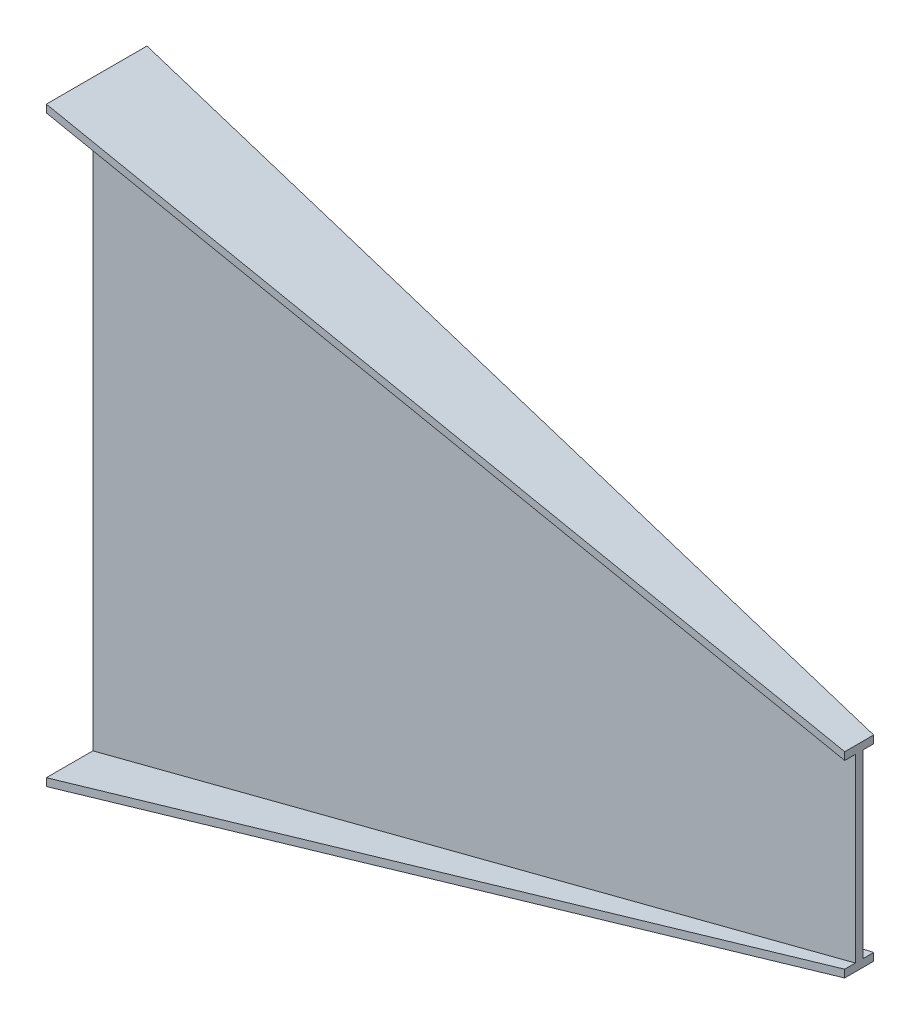
ISO-10303-21;
HEADER;
FILE_DESCRIPTION(('STEP AP214'),'2;1');
FILE_NAME('part.step','',(''),(''),'','','');
FILE_SCHEMA(('AUTOMOTIVE_DESIGN { 1 0 10303 214 1 1 1 1 }'));
ENDSEC;
DATA;
#1=APPLICATION_CONTEXT('core data for automotive mechanical design processes');
#2=APPLICATION_PROTOCOL_DEFINITION('international standard','automotive_design',2000,#1);
#3=PRODUCT_CONTEXT('',#1,'mechanical');
#4=PRODUCT('Part','Part','',(#3));
#5=PRODUCT_RELATED_PRODUCT_CATEGORY('part','',(#4));
#6=PRODUCT_DEFINITION_FORMATION('','',#4);
#7=PRODUCT_DEFINITION_CONTEXT('part definition',#1,'design');
#8=PRODUCT_DEFINITION('design','',#6,#7);
#9=PRODUCT_DEFINITION_SHAPE('','',#8);
#10=(LENGTH_UNIT() NAMED_UNIT(*) SI_UNIT(.MILLI.,.METRE.));
#11=(NAMED_UNIT(*) PLANE_ANGLE_UNIT() SI_UNIT($,.RADIAN.));
#12=(NAMED_UNIT(*) SI_UNIT($,.STERADIAN.) SOLID_ANGLE_UNIT());
#13=UNCERTAINTY_MEASURE_WITH_UNIT(LENGTH_MEASURE(1.E-05),#10,'distance_accuracy_value','');
#14=(GEOMETRIC_REPRESENTATION_CONTEXT(3) GLOBAL_UNCERTAINTY_ASSIGNED_CONTEXT((#13)) GLOBAL_UNIT_ASSIGNED_CONTEXT((#10,
#11,#12)) REPRESENTATION_CONTEXT('',''));
#15=CARTESIAN_POINT('',(0.,0.,0.));
#16=DIRECTION('',(0.,0.,1.));
#17=DIRECTION('',(1.,0.,0.));
#18=AXIS2_PLACEMENT_3D('',#15,#16,#17);
#19=CARTESIAN_POINT('',(1000.,0.,0.));
#20=DIRECTION('',(-1.,0.,0.));
#21=DIRECTION('',(0.,0.,1.));
#22=AXIS2_PLACEMENT_3D('',#19,#20,#21);
#23=PLANE('',#22);
#24=DIRECTION('',(0.,-1.,0.));
#25=VECTOR('',#24,1.);
#26=CARTESIAN_POINT('',(1000.,128.5,-13.9999999999996));
#27=LINE('',#26,#25);
#28=CARTESIAN_POINT('',(1000.,128.5,-13.9999999999996));
#29=VERTEX_POINT('',#28);
#30=CARTESIAN_POINT('',(1000.,118.5,-13.9999999999996));
#31=VERTEX_POINT('',#30);
#32=EDGE_CURVE('E377',#29,#31,#27,.T.);
#33=ORIENTED_EDGE('',*,*,#32,.F.);
#34=DIRECTION('',(0.,0.,-1.));
#35=VECTOR('',#34,1.);
#36=CARTESIAN_POINT('',(1000.,128.5,-13.9999999999996));
#37=LINE('',#36,#35);
#38=CARTESIAN_POINT('',(1000.,128.5,24.0000000000005));
#39=VERTEX_POINT('',#38);
#40=EDGE_CURVE('E12',#39,#29,#37,.T.);
#41=ORIENTED_EDGE('',*,*,#40,.F.);
#42=DIRECTION('',(0.,1.,0.));
#43=VECTOR('',#42,1.);
#44=CARTESIAN_POINT('',(1000.,128.5,24.0000000000005));
#45=LINE('',#44,#43);
#46=CARTESIAN_POINT('',(1000.,118.5,24.0000000000005));
#47=VERTEX_POINT('',#46);
#48=EDGE_CURVE('E71',#47,#39,#45,.T.);
#49=ORIENTED_EDGE('',*,*,#48,.F.);
#50=DIRECTION('',(0.,0.,1.));
#51=VECTOR('',#50,1.);
#52=CARTESIAN_POINT('',(1000.,118.5,10.0000000000005));
#53=LINE('',#52,#51);
#54=CARTESIAN_POINT('',(1000.,118.5,10.0000000000005));
#55=VERTEX_POINT('',#54);
#56=EDGE_CURVE('E652',#55,#47,#53,.T.);
#57=ORIENTED_EDGE('',*,*,#56,.F.);
#58=DIRECTION('',(0.,1.,0.));
#59=VECTOR('',#58,1.);
#60=CARTESIAN_POINT('',(1000.,118.5,10.0000000000005));
#61=LINE('',#60,#59);
#62=CARTESIAN_POINT('',(1000.,-118.5,10.0000000000005));
#63=VERTEX_POINT('',#62);
#64=EDGE_CURVE('E414',#63,#55,#61,.T.);
#65=ORIENTED_EDGE('',*,*,#64,.F.);
#66=DIRECTION('',(0.,0.,-1.));
#67=VECTOR('',#66,1.);
#68=CARTESIAN_POINT('',(1000.,-118.5,10.0000000000005));
#69=LINE('',#68,#67);
#70=CARTESIAN_POINT('',(1000.,-118.5,24.0000000000005));
#71=VERTEX_POINT('',#70);
#72=EDGE_CURVE('E428',#71,#63,#69,.T.);
#73=ORIENTED_EDGE('',*,*,#72,.F.);
#74=DIRECTION('',(0.,1.,0.));
#75=VECTOR('',#74,1.);
#76=CARTESIAN_POINT('',(1000.,-118.5,24.0000000000005));
#77=LINE('',#76,#75);
#78=CARTESIAN_POINT('',(1000.,-128.5,24.0000000000005));
#79=VERTEX_POINT('',#78);
#80=EDGE_CURVE('E442',#79,#71,#77,.T.);
#81=ORIENTED_EDGE('',*,*,#80,.F.);
#82=DIRECTION('',(0.,0.,1.));
#83=VECTOR('',#82,1.);
#84=CARTESIAN_POINT('',(1000.,-128.5,-13.9999999999996));
#85=LINE('',#84,#83);
#86=CARTESIAN_POINT('',(1000.,-128.5,-13.9999999999996));
#87=VERTEX_POINT('',#86);
#88=EDGE_CURVE('E623',#87,#79,#85,.T.);
#89=ORIENTED_EDGE('',*,*,#88,.F.);
#90=DIRECTION('',(0.,-1.,0.));
#91=VECTOR('',#90,1.);
#92=CARTESIAN_POINT('',(1000.,-118.5,-13.9999999999996));
#93=LINE('',#92,#91);
#94=CARTESIAN_POINT('',(1000.,-118.5,-13.9999999999996));
#95=VERTEX_POINT('',#94);
#96=EDGE_CURVE('E615',#95,#87,#93,.T.);
#97=ORIENTED_EDGE('',*,*,#96,.F.);
#98=DIRECTION('',(0.,0.,-1.));
#99=VECTOR('',#98,1.);
#100=CARTESIAN_POINT('',(1000.,-118.5,-13.9999999999996));
#101=LINE('',#100,#99);
#102=CARTESIAN_POINT('',(1000.,-118.5,4.44089209850063E-13));
#103=VERTEX_POINT('',#102);
#104=EDGE_CURVE('E530',#103,#95,#101,.T.);
#105=ORIENTED_EDGE('',*,*,#104,.F.);
#106=DIRECTION('',(0.,-1.,0.));
#107=VECTOR('',#106,1.);
#108=CARTESIAN_POINT('',(1000.,118.5,4.44089209850063E-13));
#109=LINE('',#108,#107);
#110=CARTESIAN_POINT('',(1000.,118.5,4.44089209850063E-13));
#111=VERTEX_POINT('',#110);
#112=EDGE_CURVE('E85',#111,#103,#109,.T.);
#113=ORIENTED_EDGE('',*,*,#112,.F.);
#114=DIRECTION('',(0.,0.,1.));
#115=VECTOR('',#114,1.);
#116=CARTESIAN_POINT('',(1000.,118.5,-13.9999999999996));
#117=LINE('',#116,#115);
#118=EDGE_CURVE('E79',#31,#111,#117,.T.);
#119=ORIENTED_EDGE('',*,*,#118,.F.);
#120=EDGE_LOOP('',(#33,#41,#49,#57,#65,#73,#81,#89,#97,#105,#113,#119));
#121=FACE_BOUND('',#120,.T.);
#122=ADVANCED_FACE('F61',(#121),#23,.F.);
#123=CARTESIAN_POINT('',(0.,0.,0.));
#124=DIRECTION('',(1.,0.,0.));
#125=DIRECTION('',(0.,0.,-1.));
#126=AXIS2_PLACEMENT_3D('',#123,#124,#125);
#127=PLANE('',#126);
#128=DIRECTION('',(0.,-1.,0.));
#129=VECTOR('',#128,1.);
#130=CARTESIAN_POINT('',(0.,387.5,71.0000000000003));
#131=LINE('',#130,#129);
#132=CARTESIAN_POINT('',(0.,387.5,71.0000000000003));
#133=VERTEX_POINT('',#132);
#134=CARTESIAN_POINT('',(0.,377.5,71.0000000000003));
#135=VERTEX_POINT('',#134);
#136=EDGE_CURVE('E160',#133,#135,#131,.T.);
#137=ORIENTED_EDGE('',*,*,#136,.F.);
#138=DIRECTION('',(0.,0.,1.));
#139=VECTOR('',#138,1.);
#140=CARTESIAN_POINT('',(0.,387.5,71.0000000000003));
#141=LINE('',#140,#139);
#142=CARTESIAN_POINT('',(0.,387.5,-60.9999999999997));
#143=VERTEX_POINT('',#142);
#144=EDGE_CURVE('E169',#143,#133,#141,.T.);
#145=ORIENTED_EDGE('',*,*,#144,.F.);
#146=DIRECTION('',(0.,1.,0.));
#147=VECTOR('',#146,1.);
#148=CARTESIAN_POINT('',(0.,387.5,-60.9999999999997));
#149=LINE('',#148,#147);
#150=CARTESIAN_POINT('',(0.,377.5,-60.9999999999997));
#151=VERTEX_POINT('',#150);
#152=EDGE_CURVE('E176',#151,#143,#149,.T.);
#153=ORIENTED_EDGE('',*,*,#152,.F.);
#154=DIRECTION('',(0.,0.,-1.));
#155=VECTOR('',#154,1.);
#156=CARTESIAN_POINT('',(0.,377.5,3.05685116652754E-13));
#157=LINE('',#156,#155);
#158=CARTESIAN_POINT('',(0.,377.5,3.05685116652754E-13));
#159=VERTEX_POINT('',#158);
#160=EDGE_CURVE('E300',#159,#151,#157,.T.);
#161=ORIENTED_EDGE('',*,*,#160,.F.);
#162=DIRECTION('',(0.,1.,0.));
#163=VECTOR('',#162,1.);
#164=CARTESIAN_POINT('',(0.,377.5,3.05685116652754E-13));
#165=LINE('',#164,#163);
#166=CARTESIAN_POINT('',(0.,-377.5,3.05685116652754E-13));
#167=VERTEX_POINT('',#166);
#168=EDGE_CURVE('E296',#167,#159,#165,.T.);
#169=ORIENTED_EDGE('',*,*,#168,.F.);
#170=DIRECTION('',(0.,0.,1.));
#171=VECTOR('',#170,1.);
#172=CARTESIAN_POINT('',(0.,-377.5,3.05685116652754E-13));
#173=LINE('',#172,#171);
#174=CARTESIAN_POINT('',(0.,-377.5,-61.));
#175=VERTEX_POINT('',#174);
#176=EDGE_CURVE('E292',#175,#167,#173,.T.);
#177=ORIENTED_EDGE('',*,*,#176,.F.);
#178=DIRECTION('',(0.,1.,0.));
#179=VECTOR('',#178,1.);
#180=CARTESIAN_POINT('',(0.,-377.5,-61.));
#181=LINE('',#180,#179);
#182=CARTESIAN_POINT('',(0.,-387.5,-61.));
#183=VERTEX_POINT('',#182);
#184=EDGE_CURVE('E288',#183,#175,#181,.T.);
#185=ORIENTED_EDGE('',*,*,#184,.F.);
#186=DIRECTION('',(0.,0.,-1.));
#187=VECTOR('',#186,1.);
#188=CARTESIAN_POINT('',(0.,-387.5,71.));
#189=LINE('',#188,#187);
#190=CARTESIAN_POINT('',(0.,-387.5,71.));
#191=VERTEX_POINT('',#190);
#192=EDGE_CURVE('E284',#191,#183,#189,.T.);
#193=ORIENTED_EDGE('',*,*,#192,.F.);
#194=DIRECTION('',(0.,-1.,0.));
#195=VECTOR('',#194,1.);
#196=CARTESIAN_POINT('',(0.,-377.5,71.0000000000001));
#197=LINE('',#196,#195);
#198=CARTESIAN_POINT('',(0.,-377.5,71.0000000000001));
#199=VERTEX_POINT('',#198);
#200=EDGE_CURVE('E280',#199,#191,#197,.T.);
#201=ORIENTED_EDGE('',*,*,#200,.F.);
#202=DIRECTION('',(0.,0.,1.));
#203=VECTOR('',#202,1.);
#204=CARTESIAN_POINT('',(0.,-377.5,71.0000000000001));
#205=LINE('',#204,#203);
#206=CARTESIAN_POINT('',(0.,-377.5,10.0000000000003));
#207=VERTEX_POINT('',#206);
#208=EDGE_CURVE('E275',#207,#199,#205,.T.);
#209=ORIENTED_EDGE('',*,*,#208,.F.);
#210=DIRECTION('',(0.,-1.,0.));
#211=VECTOR('',#210,1.);
#212=CARTESIAN_POINT('',(0.,377.5,10.0000000000003));
#213=LINE('',#212,#211);
#214=CARTESIAN_POINT('',(0.,377.5,10.0000000000003));
#215=VERTEX_POINT('',#214);
#216=EDGE_CURVE('E273',#215,#207,#213,.T.);
#217=ORIENTED_EDGE('',*,*,#216,.F.);
#218=DIRECTION('',(0.,0.,-1.));
#219=VECTOR('',#218,1.);
#220=CARTESIAN_POINT('',(0.,377.5,71.0000000000003));
#221=LINE('',#220,#219);
#222=EDGE_CURVE('E182',#135,#215,#221,.T.);
#223=ORIENTED_EDGE('',*,*,#222,.F.);
#224=EDGE_LOOP('',(#137,#145,#153,#161,#169,#177,#185,#193,#201,#209,#217,#223));
#225=FACE_BOUND('',#224,.T.);
#226=ADVANCED_FACE('F180',(#225),#127,.F.);
#227=CARTESIAN_POINT('',(0.,0.,10.0000000000003));
#228=DIRECTION('',(0.,0.,1.));
#229=DIRECTION('',(1.,0.,0.));
#230=AXIS2_PLACEMENT_3D('',#227,#228,#229);
#231=PLANE('',#230);
#232=DIRECTION('',(0.968057839822749,0.250726980514092,0.));
#233=VECTOR('',#232,1.);
#234=CARTESIAN_POINT('',(0.,-377.5,10.0000000000003));
#235=LINE('',#234,#233);
#236=EDGE_CURVE('E175',#207,#63,#235,.T.);
#237=ORIENTED_EDGE('',*,*,#236,.T.);
#238=ORIENTED_EDGE('',*,*,#64,.T.);
#239=DIRECTION('',(0.968057839822749,-0.250726980514092,0.));
#240=VECTOR('',#239,1.);
#241=CARTESIAN_POINT('',(0.,377.5,10.0000000000003));
#242=LINE('',#241,#240);
#243=EDGE_CURVE('E387',#215,#55,#242,.T.);
#244=ORIENTED_EDGE('',*,*,#243,.F.);
#245=ORIENTED_EDGE('',*,*,#216,.T.);
#246=EDGE_LOOP('',(#237,#238,#244,#245));
#247=FACE_BOUND('',#246,.T.);
#248=ADVANCED_FACE('F203',(#247),#231,.T.);
#249=CARTESIAN_POINT('',(91.6261277260114,353.768832918963,-3.50680628304824E-13));
#250=DIRECTION('',(-0.250726980514092,-0.968057839822749,0.));
#251=DIRECTION('',(0.968057839822749,-0.250726980514092,0.));
#252=AXIS2_PLACEMENT_3D('',#249,#250,#251);
#253=PLANE('',#252);
#254=ORIENTED_EDGE('',*,*,#243,.T.);
#255=ORIENTED_EDGE('',*,*,#56,.T.);
#256=DIRECTION('',(0.967057388430697,-0.250467863603551,-0.0454516972562426));
#257=VECTOR('',#256,1.);
#258=CARTESIAN_POINT('',(0.,377.5,71.0000000000003));
#259=LINE('',#258,#257);
#260=EDGE_CURVE('E165',#135,#47,#259,.T.);
#261=ORIENTED_EDGE('',*,*,#260,.F.);
#262=ORIENTED_EDGE('',*,*,#222,.T.);
#263=EDGE_LOOP('',(#254,#255,#261,#262));
#264=FACE_BOUND('',#263,.T.);
#265=ADVANCED_FACE('F389',(#264),#253,.T.);
#266=CARTESIAN_POINT('',(91.6261277260114,-353.768832918963,-3.50680628304824E-13));
#267=DIRECTION('',(-0.250726980514092,0.968057839822749,0.));
#268=DIRECTION('',(-0.968057839822749,-0.250726980514092,0.));
#269=AXIS2_PLACEMENT_3D('',#266,#267,#268);
#270=PLANE('',#269);
#271=DIRECTION('',(0.967057388430697,0.250467863603551,-0.0454516972562424));
#272=VECTOR('',#271,1.);
#273=CARTESIAN_POINT('',(0.,-377.5,71.0000000000001));
#274=LINE('',#273,#272);
#275=EDGE_CURVE('E475',#199,#71,#274,.T.);
#276=ORIENTED_EDGE('',*,*,#275,.T.);
#277=ORIENTED_EDGE('',*,*,#72,.T.);
#278=ORIENTED_EDGE('',*,*,#236,.F.);
#279=ORIENTED_EDGE('',*,*,#208,.T.);
#280=EDGE_LOOP('',(#276,#277,#278,#279));
#281=FACE_BOUND('',#280,.T.);
#282=ADVANCED_FACE('F398',(#281),#270,.T.);
#283=CARTESIAN_POINT('',(3.32964481460451,0.,70.8435066937136));
#284=DIRECTION('',(0.0469481743463629,0.,0.998897326518368));
#285=DIRECTION('',(0.998897326518368,0.,-0.0469481743463629));
#286=AXIS2_PLACEMENT_3D('',#283,#284,#285);
#287=PLANE('',#286);
#288=DIRECTION('',(0.967057388430697,0.250467863603551,-0.0454516972562424));
#289=VECTOR('',#288,1.);
#290=CARTESIAN_POINT('',(0.,-387.5,71.));
#291=LINE('',#290,#289);
#292=EDGE_CURVE('E467',#191,#79,#291,.T.);
#293=ORIENTED_EDGE('',*,*,#292,.T.);
#294=ORIENTED_EDGE('',*,*,#80,.T.);
#295=ORIENTED_EDGE('',*,*,#275,.F.);
#296=ORIENTED_EDGE('',*,*,#200,.T.);
#297=EDGE_LOOP('',(#293,#294,#295,#296));
#298=FACE_BOUND('',#297,.T.);
#299=ADVANCED_FACE('F448',(#298),#287,.T.);
#300=CARTESIAN_POINT('',(94.053309917429,-363.140192731386,0.));
#301=DIRECTION('',(0.250726980514092,-0.968057839822749,0.));
#302=DIRECTION('',(0.968057839822749,0.250726980514092,0.));
#303=AXIS2_PLACEMENT_3D('',#300,#301,#302);
#304=PLANE('',#303);
#305=DIRECTION('',(0.967057388430697,0.250467863603551,0.0454516972562431));
#306=VECTOR('',#305,1.);
#307=CARTESIAN_POINT('',(0.,-387.5,-61.));
#308=LINE('',#307,#306);
#309=EDGE_CURVE('E474',#183,#87,#308,.T.);
#310=ORIENTED_EDGE('',*,*,#309,.T.);
#311=ORIENTED_EDGE('',*,*,#88,.T.);
#312=ORIENTED_EDGE('',*,*,#292,.F.);
#313=ORIENTED_EDGE('',*,*,#192,.T.);
#314=EDGE_LOOP('',(#310,#311,#312,#313));
#315=FACE_BOUND('',#314,.T.);
#316=ADVANCED_FACE('F457',(#315),#304,.T.);
#317=CARTESIAN_POINT('',(2.86068075620956,0.,-60.8655480044582));
#318=DIRECTION('',(0.0469481743463637,0.,-0.998897326518368));
#319=DIRECTION('',(-0.998897326518368,0.,-0.0469481743463637));
#320=AXIS2_PLACEMENT_3D('',#317,#318,#319);
#321=PLANE('',#320);
#322=DIRECTION('',(0.967057388430697,0.250467863603551,0.0454516972562432));
#323=VECTOR('',#322,1.);
#324=CARTESIAN_POINT('',(0.,-377.5,-61.));
#325=LINE('',#324,#323);
#326=EDGE_CURVE('E492',#175,#95,#325,.T.);
#327=ORIENTED_EDGE('',*,*,#326,.T.);
#328=ORIENTED_EDGE('',*,*,#96,.T.);
#329=ORIENTED_EDGE('',*,*,#309,.F.);
#330=ORIENTED_EDGE('',*,*,#184,.T.);
#331=EDGE_LOOP('',(#327,#328,#329,#330));
#332=FACE_BOUND('',#331,.T.);
#333=ADVANCED_FACE('F503',(#332),#321,.T.);
#334=CARTESIAN_POINT('',(91.6261277260114,-353.768832918963,3.50680628304824E-13));
#335=DIRECTION('',(-0.250726980514092,0.968057839822749,0.));
#336=DIRECTION('',(-0.968057839822749,-0.250726980514092,0.));
#337=AXIS2_PLACEMENT_3D('',#334,#335,#336);
#338=PLANE('',#337);
#339=DIRECTION('',(0.968057839822749,0.250726980514092,0.));
#340=VECTOR('',#339,1.);
#341=CARTESIAN_POINT('',(0.,-377.5,3.05685116652754E-13));
#342=LINE('',#341,#340);
#343=EDGE_CURVE('E569',#167,#103,#342,.T.);
#344=ORIENTED_EDGE('',*,*,#343,.T.);
#345=ORIENTED_EDGE('',*,*,#104,.T.);
#346=ORIENTED_EDGE('',*,*,#326,.F.);
#347=ORIENTED_EDGE('',*,*,#176,.T.);
#348=EDGE_LOOP('',(#344,#345,#346,#347));
#349=FACE_BOUND('',#348,.T.);
#350=ADVANCED_FACE('F512',(#349),#338,.T.);
#351=CARTESIAN_POINT('',(0.,0.,3.05685116652754E-13));
#352=DIRECTION('',(0.,0.,-1.));
#353=DIRECTION('',(-1.,0.,0.));
#354=AXIS2_PLACEMENT_3D('',#351,#352,#353);
#355=PLANE('',#354);
#356=DIRECTION('',(0.968057839822749,-0.250726980514092,0.));
#357=VECTOR('',#356,1.);
#358=CARTESIAN_POINT('',(0.,377.5,3.05685116652754E-13));
#359=LINE('',#358,#357);
#360=EDGE_CURVE('E561',#159,#111,#359,.T.);
#361=ORIENTED_EDGE('',*,*,#360,.T.);
#362=ORIENTED_EDGE('',*,*,#112,.T.);
#363=ORIENTED_EDGE('',*,*,#343,.F.);
#364=ORIENTED_EDGE('',*,*,#168,.T.);
#365=EDGE_LOOP('',(#361,#362,#363,#364));
#366=FACE_BOUND('',#365,.T.);
#367=ADVANCED_FACE('F546',(#366),#355,.T.);
#368=CARTESIAN_POINT('',(91.6261277260115,353.768832918963,3.50680628304824E-13));
#369=DIRECTION('',(-0.250726980514092,-0.968057839822749,0.));
#370=DIRECTION('',(0.968057839822749,-0.250726980514092,0.));
#371=AXIS2_PLACEMENT_3D('',#368,#369,#370);
#372=PLANE('',#371);
#373=DIRECTION('',(0.967057388430697,-0.250467863603551,0.0454516972562429));
#374=VECTOR('',#373,1.);
#375=CARTESIAN_POINT('',(0.,377.5,-60.9999999999997));
#376=LINE('',#375,#374);
#377=EDGE_CURVE('E568',#151,#31,#376,.T.);
#378=ORIENTED_EDGE('',*,*,#377,.T.);
#379=ORIENTED_EDGE('',*,*,#118,.T.);
#380=ORIENTED_EDGE('',*,*,#360,.F.);
#381=ORIENTED_EDGE('',*,*,#160,.T.);
#382=EDGE_LOOP('',(#378,#379,#380,#381));
#383=FACE_BOUND('',#382,.T.);
#384=ADVANCED_FACE('F327',(#383),#372,.T.);
#385=CARTESIAN_POINT('',(2.86068075620953,0.,-60.8655480044579));
#386=DIRECTION('',(0.0469481743463635,0.,-0.998897326518368));
#387=DIRECTION('',(-0.998897326518368,0.,-0.0469481743463635));
#388=AXIS2_PLACEMENT_3D('',#385,#386,#387);
#389=PLANE('',#388);
#390=DIRECTION('',(0.967057388430697,-0.250467863603551,0.0454516972562429));
#391=VECTOR('',#390,1.);
#392=CARTESIAN_POINT('',(0.,387.5,-60.9999999999997));
#393=LINE('',#392,#391);
#394=EDGE_CURVE('E166',#143,#29,#393,.T.);
#395=ORIENTED_EDGE('',*,*,#394,.T.);
#396=ORIENTED_EDGE('',*,*,#32,.T.);
#397=ORIENTED_EDGE('',*,*,#377,.F.);
#398=ORIENTED_EDGE('',*,*,#152,.T.);
#399=EDGE_LOOP('',(#395,#396,#397,#398));
#400=FACE_BOUND('',#399,.T.);
#401=ADVANCED_FACE('F317',(#400),#389,.T.);
#402=CARTESIAN_POINT('',(94.053309917429,363.140192731386,0.));
#403=DIRECTION('',(0.250726980514092,0.968057839822749,0.));
#404=DIRECTION('',(-0.968057839822748,0.250726980514092,0.));
#405=AXIS2_PLACEMENT_3D('',#402,#403,#404);
#406=PLANE('',#405);
#407=DIRECTION('',(0.967057388430697,-0.250467863603551,-0.0454516972562426));
#408=VECTOR('',#407,1.);
#409=CARTESIAN_POINT('',(0.,387.5,71.0000000000003));
#410=LINE('',#409,#408);
#411=EDGE_CURVE('E155',#133,#39,#410,.T.);
#412=ORIENTED_EDGE('',*,*,#411,.T.);
#413=ORIENTED_EDGE('',*,*,#40,.T.);
#414=ORIENTED_EDGE('',*,*,#394,.F.);
#415=ORIENTED_EDGE('',*,*,#144,.T.);
#416=EDGE_LOOP('',(#412,#413,#414,#415));
#417=FACE_BOUND('',#416,.T.);
#418=ADVANCED_FACE('F171',(#417),#406,.T.);
#419=CARTESIAN_POINT('',(3.32964481460454,0.,70.8435066937139));
#420=DIRECTION('',(0.0469481743463631,0.,0.998897326518368));
#421=DIRECTION('',(0.998897326518368,0.,-0.0469481743463631));
#422=AXIS2_PLACEMENT_3D('',#419,#420,#421);
#423=PLANE('',#422);
#424=ORIENTED_EDGE('',*,*,#260,.T.);
#425=ORIENTED_EDGE('',*,*,#48,.T.);
#426=ORIENTED_EDGE('',*,*,#411,.F.);
#427=ORIENTED_EDGE('',*,*,#136,.T.);
#428=EDGE_LOOP('',(#424,#425,#426,#427));
#429=FACE_BOUND('',#428,.T.);
#430=ADVANCED_FACE('F158',(#429),#423,.T.);
#431=CLOSED_SHELL('',(#122,#226,#248,#265,#282,#299,#316,#333,#350,#367,#384,#401,#418,#430));
#432=MANIFOLD_SOLID_BREP('B2',#431);
#433=ADVANCED_BREP_SHAPE_REPRESENTATION('',(#18,#432),#14);
#434=SHAPE_DEFINITION_REPRESENTATION(#9,#433);
ENDSEC;
END-ISO-10303-21;
